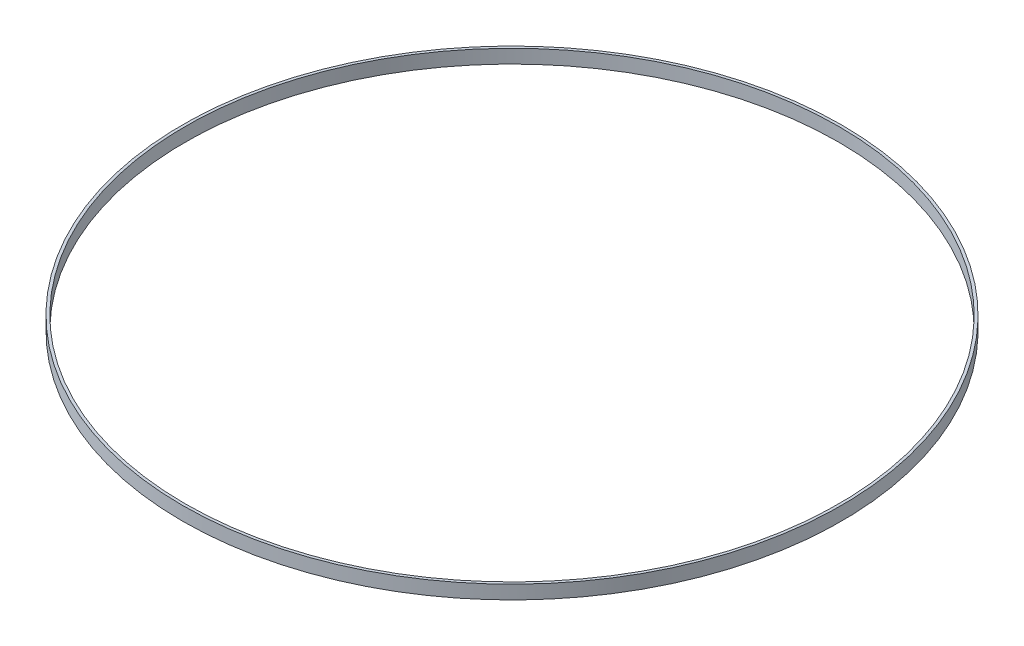
ISO-10303-21;
HEADER;
FILE_DESCRIPTION(('STEP AP214'),'2;1');
FILE_NAME('part.step','',(''),(''),'','','');
FILE_SCHEMA(('AUTOMOTIVE_DESIGN { 1 0 10303 214 1 1 1 1 }'));
ENDSEC;
DATA;
#1=APPLICATION_CONTEXT('core data for automotive mechanical design processes');
#2=APPLICATION_PROTOCOL_DEFINITION('international standard','automotive_design',2000,#1);
#3=PRODUCT_CONTEXT('',#1,'mechanical');
#4=PRODUCT('Part','Part','',(#3));
#5=PRODUCT_RELATED_PRODUCT_CATEGORY('part','',(#4));
#6=PRODUCT_DEFINITION_FORMATION('','',#4);
#7=PRODUCT_DEFINITION_CONTEXT('part definition',#1,'design');
#8=PRODUCT_DEFINITION('design','',#6,#7);
#9=PRODUCT_DEFINITION_SHAPE('','',#8);
#10=(LENGTH_UNIT() NAMED_UNIT(*) SI_UNIT(.MILLI.,.METRE.));
#11=(NAMED_UNIT(*) PLANE_ANGLE_UNIT() SI_UNIT($,.RADIAN.));
#12=(NAMED_UNIT(*) SI_UNIT($,.STERADIAN.) SOLID_ANGLE_UNIT());
#13=UNCERTAINTY_MEASURE_WITH_UNIT(LENGTH_MEASURE(1.E-05),#10,'distance_accuracy_value','');
#14=(GEOMETRIC_REPRESENTATION_CONTEXT(3) GLOBAL_UNCERTAINTY_ASSIGNED_CONTEXT((#13)) GLOBAL_UNIT_ASSIGNED_CONTEXT((#10,
#11,#12)) REPRESENTATION_CONTEXT('',''));
#15=CARTESIAN_POINT('',(0.,0.,0.));
#16=DIRECTION('',(0.,0.,1.));
#17=DIRECTION('',(1.,0.,0.));
#18=AXIS2_PLACEMENT_3D('',#15,#16,#17);
#19=CARTESIAN_POINT('',(0.,1.27,0.));
#20=DIRECTION('',(0.,1.,0.));
#21=DIRECTION('',(0.,0.,1.));
#22=AXIS2_PLACEMENT_3D('',#19,#20,#21);
#23=PLANE('',#22);
#24=CARTESIAN_POINT('',(0.,1.27,0.));
#25=DIRECTION('',(0.,1.,0.));
#26=DIRECTION('',(0.,0.,1.));
#27=AXIS2_PLACEMENT_3D('',#24,#25,#26);
#28=CIRCLE('',#27,30.5943);
#29=CARTESIAN_POINT('',(0.,1.27,30.5943));
#30=VERTEX_POINT('',#29);
#31=EDGE_CURVE('E10',#30,#30,#28,.T.);
#32=ORIENTED_EDGE('',*,*,#31,.T.);
#33=EDGE_LOOP('',(#32));
#34=FACE_BOUND('',#33,.T.);
#35=CARTESIAN_POINT('',(0.,1.27,0.));
#36=DIRECTION('',(0.,1.,0.));
#37=DIRECTION('',(0.,0.,1.));
#38=AXIS2_PLACEMENT_3D('',#35,#36,#37);
#39=CIRCLE('',#38,30.3403);
#40=CARTESIAN_POINT('',(0.,1.27,30.3403));
#41=VERTEX_POINT('',#40);
#42=EDGE_CURVE('E50',#41,#41,#39,.T.);
#43=ORIENTED_EDGE('',*,*,#42,.F.);
#44=EDGE_LOOP('',(#43));
#45=FACE_BOUND('',#44,.T.);
#46=ADVANCED_FACE('F37',(#34,#45),#23,.T.);
#47=CARTESIAN_POINT('',(0.,0.,0.));
#48=DIRECTION('',(0.,1.,0.));
#49=DIRECTION('',(0.,0.,1.));
#50=AXIS2_PLACEMENT_3D('',#47,#48,#49);
#51=PLANE('',#50);
#52=CARTESIAN_POINT('',(0.,0.,0.));
#53=DIRECTION('',(0.,1.,0.));
#54=DIRECTION('',(0.,0.,1.));
#55=AXIS2_PLACEMENT_3D('',#52,#53,#54);
#56=CIRCLE('',#55,30.5943);
#57=CARTESIAN_POINT('',(0.,0.,30.5943));
#58=VERTEX_POINT('',#57);
#59=EDGE_CURVE('E41',#58,#58,#56,.T.);
#60=ORIENTED_EDGE('',*,*,#59,.F.);
#61=EDGE_LOOP('',(#60));
#62=FACE_BOUND('',#61,.T.);
#63=CARTESIAN_POINT('',(0.,0.,0.));
#64=DIRECTION('',(0.,1.,0.));
#65=DIRECTION('',(0.,0.,1.));
#66=AXIS2_PLACEMENT_3D('',#63,#64,#65);
#67=CIRCLE('',#66,30.3403);
#68=CARTESIAN_POINT('',(0.,0.,30.3403));
#69=VERTEX_POINT('',#68);
#70=EDGE_CURVE('E52',#69,#69,#67,.T.);
#71=ORIENTED_EDGE('',*,*,#70,.T.);
#72=EDGE_LOOP('',(#71));
#73=FACE_BOUND('',#72,.T.);
#74=ADVANCED_FACE('F64',(#62,#73),#51,.F.);
#75=CARTESIAN_POINT('',(0.,1.27,0.));
#76=DIRECTION('',(0.,-1.,0.));
#77=DIRECTION('',(0.,0.,-1.));
#78=AXIS2_PLACEMENT_3D('',#75,#76,#77);
#79=CYLINDRICAL_SURFACE('',#78,30.5943);
#80=ORIENTED_EDGE('',*,*,#31,.F.);
#81=EDGE_LOOP('',(#80));
#82=FACE_BOUND('',#81,.T.);
#83=ORIENTED_EDGE('',*,*,#59,.T.);
#84=EDGE_LOOP('',(#83));
#85=FACE_BOUND('',#84,.T.);
#86=ADVANCED_FACE('F39',(#82,#85),#79,.T.);
#87=CARTESIAN_POINT('',(0.,1.27,0.));
#88=DIRECTION('',(0.,-1.,0.));
#89=DIRECTION('',(0.,0.,-1.));
#90=AXIS2_PLACEMENT_3D('',#87,#88,#89);
#91=CYLINDRICAL_SURFACE('',#90,30.3403);
#92=ORIENTED_EDGE('',*,*,#42,.T.);
#93=EDGE_LOOP('',(#92));
#94=FACE_BOUND('',#93,.T.);
#95=ORIENTED_EDGE('',*,*,#70,.F.);
#96=EDGE_LOOP('',(#95));
#97=FACE_BOUND('',#96,.T.);
#98=ADVANCED_FACE('F60',(#94,#97),#91,.F.);
#99=CLOSED_SHELL('',(#46,#74,#86,#98));
#100=MANIFOLD_SOLID_BREP('B2',#99);
#101=ADVANCED_BREP_SHAPE_REPRESENTATION('',(#18,#100),#14);
#102=SHAPE_DEFINITION_REPRESENTATION(#9,#101);
ENDSEC;
END-ISO-10303-21;
